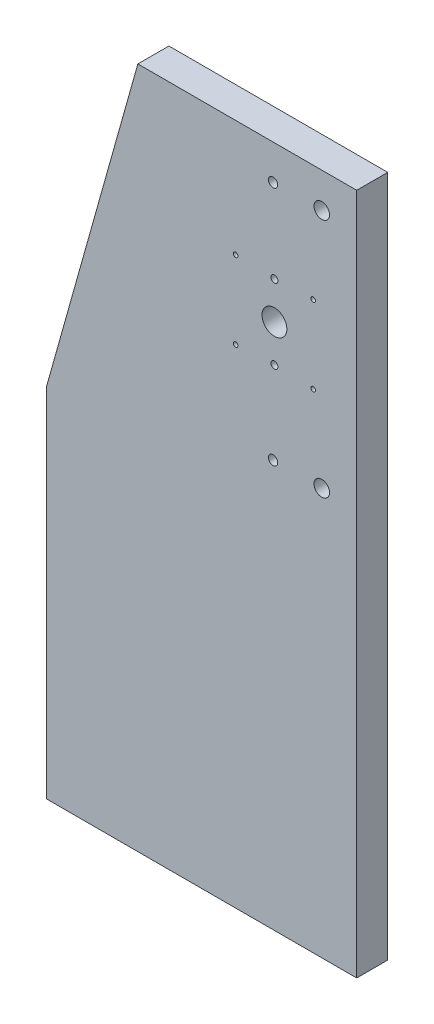
ISO-10303-21;
HEADER;
FILE_DESCRIPTION(('STEP AP214'),'2;1');
FILE_NAME('part.step','',(''),(''),'','','');
FILE_SCHEMA(('AUTOMOTIVE_DESIGN { 1 0 10303 214 1 1 1 1 }'));
ENDSEC;
DATA;
#1=APPLICATION_CONTEXT('core data for automotive mechanical design processes');
#2=APPLICATION_PROTOCOL_DEFINITION('international standard','automotive_design',2000,#1);
#3=PRODUCT_CONTEXT('',#1,'mechanical');
#4=PRODUCT('Part','Part','',(#3));
#5=PRODUCT_RELATED_PRODUCT_CATEGORY('part','',(#4));
#6=PRODUCT_DEFINITION_FORMATION('','',#4);
#7=PRODUCT_DEFINITION_CONTEXT('part definition',#1,'design');
#8=PRODUCT_DEFINITION('design','',#6,#7);
#9=PRODUCT_DEFINITION_SHAPE('','',#8);
#10=(LENGTH_UNIT() NAMED_UNIT(*) SI_UNIT(.MILLI.,.METRE.));
#11=(NAMED_UNIT(*) PLANE_ANGLE_UNIT() SI_UNIT($,.RADIAN.));
#12=(NAMED_UNIT(*) SI_UNIT($,.STERADIAN.) SOLID_ANGLE_UNIT());
#13=UNCERTAINTY_MEASURE_WITH_UNIT(LENGTH_MEASURE(1.E-05),#10,'distance_accuracy_value','');
#14=(GEOMETRIC_REPRESENTATION_CONTEXT(3) GLOBAL_UNCERTAINTY_ASSIGNED_CONTEXT((#13)) GLOBAL_UNIT_ASSIGNED_CONTEXT((#10,
#11,#12)) REPRESENTATION_CONTEXT('',''));
#15=CARTESIAN_POINT('',(0.,0.,0.));
#16=DIRECTION('',(0.,0.,1.));
#17=DIRECTION('',(1.,0.,0.));
#18=AXIS2_PLACEMENT_3D('',#15,#16,#17);
#19=CARTESIAN_POINT('',(126.12492067,261.999912039992,20.));
#20=DIRECTION('',(0.,0.,-1.));
#21=DIRECTION('',(-1.,0.,0.));
#22=AXIS2_PLACEMENT_3D('',#19,#20,#21);
#23=CYLINDRICAL_SURFACE('',#22,2.99999999999999);
#24=CARTESIAN_POINT('',(126.12492067,261.999912039992,20.));
#25=DIRECTION('',(0.,0.,1.));
#26=DIRECTION('',(1.,0.,0.));
#27=AXIS2_PLACEMENT_3D('',#24,#25,#26);
#28=CIRCLE('',#27,2.99999999999999);
#29=CARTESIAN_POINT('',(129.12492067,261.999912039992,20.));
#30=VERTEX_POINT('',#29);
#31=EDGE_CURVE('E123',#30,#30,#28,.T.);
#32=ORIENTED_EDGE('',*,*,#31,.T.);
#33=EDGE_LOOP('',(#32));
#34=FACE_BOUND('',#33,.T.);
#35=CARTESIAN_POINT('',(126.12492067,261.999912039992,6.));
#36=DIRECTION('',(0.,0.,-1.));
#37=DIRECTION('',(-1.,0.,0.));
#38=AXIS2_PLACEMENT_3D('',#35,#36,#37);
#39=CIRCLE('',#38,2.99999999999999);
#40=CARTESIAN_POINT('',(123.12492067,261.999912039992,6.));
#41=VERTEX_POINT('',#40);
#42=EDGE_CURVE('E33',#41,#41,#39,.T.);
#43=ORIENTED_EDGE('',*,*,#42,.T.);
#44=EDGE_LOOP('',(#43));
#45=FACE_BOUND('',#44,.T.);
#46=ADVANCED_FACE('F29',(#34,#45),#23,.F.);
#47=CARTESIAN_POINT('',(126.12492067,416.999970679992,20.));
#48=DIRECTION('',(0.,0.,-1.));
#49=DIRECTION('',(-1.,0.,0.));
#50=AXIS2_PLACEMENT_3D('',#47,#48,#49);
#51=CYLINDRICAL_SURFACE('',#50,2.99999999999999);
#52=CARTESIAN_POINT('',(126.12492067,416.999970679992,20.));
#53=DIRECTION('',(0.,0.,1.));
#54=DIRECTION('',(1.,0.,0.));
#55=AXIS2_PLACEMENT_3D('',#52,#53,#54);
#56=CIRCLE('',#55,2.99999999999999);
#57=CARTESIAN_POINT('',(129.12492067,416.999970679992,20.));
#58=VERTEX_POINT('',#57);
#59=EDGE_CURVE('E96',#58,#58,#56,.T.);
#60=ORIENTED_EDGE('',*,*,#59,.T.);
#61=EDGE_LOOP('',(#60));
#62=FACE_BOUND('',#61,.T.);
#63=CARTESIAN_POINT('',(126.12492067,416.999970679992,6.));
#64=DIRECTION('',(0.,0.,-1.));
#65=DIRECTION('',(-1.,0.,0.));
#66=AXIS2_PLACEMENT_3D('',#63,#64,#65);
#67=CIRCLE('',#66,2.99999999999999);
#68=CARTESIAN_POINT('',(123.12492067,416.999970679992,6.));
#69=VERTEX_POINT('',#68);
#70=EDGE_CURVE('E129',#69,#69,#67,.T.);
#71=ORIENTED_EDGE('',*,*,#70,.T.);
#72=EDGE_LOOP('',(#71));
#73=FACE_BOUND('',#72,.T.);
#74=ADVANCED_FACE('F274',(#62,#73),#51,.F.);
#75=CARTESIAN_POINT('',(157.49992067,261.999912039992,20.));
#76=DIRECTION('',(0.,0.,-1.));
#77=DIRECTION('',(-1.,0.,0.));
#78=AXIS2_PLACEMENT_3D('',#75,#76,#77);
#79=CYLINDRICAL_SURFACE('',#78,4.99999999999999);
#80=CARTESIAN_POINT('',(157.49992067,261.999912039992,20.));
#81=DIRECTION('',(0.,0.,1.));
#82=DIRECTION('',(1.,0.,0.));
#83=AXIS2_PLACEMENT_3D('',#80,#81,#82);
#84=CIRCLE('',#83,4.99999999999999);
#85=CARTESIAN_POINT('',(162.49992067,261.999912039992,20.));
#86=VERTEX_POINT('',#85);
#87=EDGE_CURVE('E232',#86,#86,#84,.T.);
#88=ORIENTED_EDGE('',*,*,#87,.T.);
#89=EDGE_LOOP('',(#88));
#90=FACE_BOUND('',#89,.T.);
#91=CARTESIAN_POINT('',(157.49992067,261.999912039992,10.));
#92=DIRECTION('',(0.,0.,-1.));
#93=DIRECTION('',(-1.,0.,0.));
#94=AXIS2_PLACEMENT_3D('',#91,#92,#93);
#95=CIRCLE('',#94,4.99999999999999);
#96=CARTESIAN_POINT('',(152.49992067,261.999912039992,10.));
#97=VERTEX_POINT('',#96);
#98=EDGE_CURVE('E125',#97,#97,#95,.T.);
#99=ORIENTED_EDGE('',*,*,#98,.T.);
#100=EDGE_LOOP('',(#99));
#101=FACE_BOUND('',#100,.T.);
#102=ADVANCED_FACE('F281',(#90,#101),#79,.F.);
#103=CARTESIAN_POINT('',(157.49992067,416.999970679992,20.));
#104=DIRECTION('',(0.,0.,-1.));
#105=DIRECTION('',(-1.,0.,0.));
#106=AXIS2_PLACEMENT_3D('',#103,#104,#105);
#107=CYLINDRICAL_SURFACE('',#106,4.99999999999999);
#108=CARTESIAN_POINT('',(157.49992067,416.999970679992,20.));
#109=DIRECTION('',(0.,0.,1.));
#110=DIRECTION('',(1.,0.,0.));
#111=AXIS2_PLACEMENT_3D('',#108,#109,#110);
#112=CIRCLE('',#111,4.99999999999999);
#113=CARTESIAN_POINT('',(162.49992067,416.999970679992,20.));
#114=VERTEX_POINT('',#113);
#115=EDGE_CURVE('E235',#114,#114,#112,.T.);
#116=ORIENTED_EDGE('',*,*,#115,.T.);
#117=EDGE_LOOP('',(#116));
#118=FACE_BOUND('',#117,.T.);
#119=CARTESIAN_POINT('',(157.49992067,416.999970679992,10.));
#120=DIRECTION('',(0.,0.,-1.));
#121=DIRECTION('',(-1.,0.,0.));
#122=AXIS2_PLACEMENT_3D('',#119,#120,#121);
#123=CIRCLE('',#122,4.99999999999999);
#124=CARTESIAN_POINT('',(152.49992067,416.999970679992,10.));
#125=VERTEX_POINT('',#124);
#126=EDGE_CURVE('E120',#125,#125,#123,.T.);
#127=ORIENTED_EDGE('',*,*,#126,.T.);
#128=EDGE_LOOP('',(#127));
#129=FACE_BOUND('',#128,.T.);
#130=ADVANCED_FACE('F308',(#118,#129),#107,.F.);
#131=CARTESIAN_POINT('',(180.,0.,20.));
#132=DIRECTION('',(0.,0.,1.));
#133=DIRECTION('',(1.,0.,0.));
#134=AXIS2_PLACEMENT_3D('',#131,#132,#133);
#135=PLANE('',#134);
#136=CARTESIAN_POINT('',(101.999907999992,314.499941359992,20.));
#137=DIRECTION('',(0.,0.,1.));
#138=DIRECTION('',(1.,0.,0.));
#139=AXIS2_PLACEMENT_3D('',#136,#137,#138);
#140=CIRCLE('',#139,1.5);
#141=CARTESIAN_POINT('',(103.499907999992,314.499941359992,20.));
#142=VERTEX_POINT('',#141);
#143=EDGE_CURVE('E211',#142,#142,#140,.T.);
#144=ORIENTED_EDGE('',*,*,#143,.F.);
#145=EDGE_LOOP('',(#144));
#146=FACE_BOUND('',#145,.T.);
#147=CARTESIAN_POINT('',(151.999907999992,314.499941359992,20.));
#148=DIRECTION('',(0.,0.,1.));
#149=DIRECTION('',(1.,0.,0.));
#150=AXIS2_PLACEMENT_3D('',#147,#148,#149);
#151=CIRCLE('',#150,1.5);
#152=CARTESIAN_POINT('',(153.499907999992,314.499941359992,20.));
#153=VERTEX_POINT('',#152);
#154=EDGE_CURVE('E223',#153,#153,#151,.T.);
#155=ORIENTED_EDGE('',*,*,#154,.F.);
#156=EDGE_LOOP('',(#155));
#157=FACE_BOUND('',#156,.T.);
#158=ORIENTED_EDGE('',*,*,#87,.F.);
#159=EDGE_LOOP('',(#158));
#160=FACE_BOUND('',#159,.T.);
#161=CARTESIAN_POINT('',(126.999907999992,363.499941359992,20.));
#162=DIRECTION('',(0.,0.,1.));
#163=DIRECTION('',(1.,0.,0.));
#164=AXIS2_PLACEMENT_3D('',#161,#162,#163);
#165=CIRCLE('',#164,2.25000000000001);
#166=CARTESIAN_POINT('',(129.249907999992,363.499941359992,20.));
#167=VERTEX_POINT('',#166);
#168=EDGE_CURVE('E241',#167,#167,#165,.T.);
#169=ORIENTED_EDGE('',*,*,#168,.F.);
#170=EDGE_LOOP('',(#169));
#171=FACE_BOUND('',#170,.T.);
#172=CARTESIAN_POINT('',(126.999907999993,339.499941359992,20.));
#173=DIRECTION('',(0.,0.,1.));
#174=DIRECTION('',(1.,0.,0.));
#175=AXIS2_PLACEMENT_3D('',#172,#173,#174);
#176=CIRCLE('',#175,7.99999999999996);
#177=CARTESIAN_POINT('',(134.999907999992,339.499941359992,20.));
#178=VERTEX_POINT('',#177);
#179=EDGE_CURVE('E253',#178,#178,#176,.T.);
#180=ORIENTED_EDGE('',*,*,#179,.F.);
#181=EDGE_LOOP('',(#180));
#182=FACE_BOUND('',#181,.T.);
#183=DIRECTION('',(0.,1.,0.));
#184=VECTOR('',#183,1.);
#185=CARTESIAN_POINT('',(180.,20.,20.));
#186=LINE('',#185,#184);
#187=CARTESIAN_POINT('',(180.,0.,20.));
#188=VERTEX_POINT('',#187);
#189=CARTESIAN_POINT('',(180.,439.500014530256,20.));
#190=VERTEX_POINT('',#189);
#191=EDGE_CURVE('E46',#188,#190,#186,.T.);
#192=ORIENTED_EDGE('',*,*,#191,.T.);
#193=DIRECTION('',(-0.999999999999865,-5.18937700120816E-07,0.));
#194=VECTOR('',#193,1.);
#195=CARTESIAN_POINT('',(180.,439.500014530256,20.));
#196=LINE('',#195,#194);
#197=CARTESIAN_POINT('',(38.9999079999848,439.499941359992,20.));
#198=VERTEX_POINT('',#197);
#199=EDGE_CURVE('E98',#190,#198,#196,.T.);
#200=ORIENTED_EDGE('',*,*,#199,.T.);
#201=DIRECTION('',(-0.270479653463599,-0.962725691493798,0.));
#202=VECTOR('',#201,1.);
#203=CARTESIAN_POINT('',(38.9999079999848,439.499941359992,20.));
#204=LINE('',#203,#202);
#205=CARTESIAN_POINT('',(-20.,229.499941359992,20.));
#206=VERTEX_POINT('',#205);
#207=EDGE_CURVE('E100',#198,#206,#204,.T.);
#208=ORIENTED_EDGE('',*,*,#207,.T.);
#209=DIRECTION('',(0.,-1.,0.));
#210=VECTOR('',#209,1.);
#211=CARTESIAN_POINT('',(-20.,229.499941359992,20.));
#212=LINE('',#211,#210);
#213=CARTESIAN_POINT('',(-20.,0.,20.));
#214=VERTEX_POINT('',#213);
#215=EDGE_CURVE('E53',#206,#214,#212,.T.);
#216=ORIENTED_EDGE('',*,*,#215,.T.);
#217=DIRECTION('',(1.,0.,0.));
#218=VECTOR('',#217,1.);
#219=CARTESIAN_POINT('',(180.,0.,20.));
#220=LINE('',#219,#218);
#221=EDGE_CURVE('E105',#214,#188,#220,.T.);
#222=ORIENTED_EDGE('',*,*,#221,.T.);
#223=EDGE_LOOP('',(#192,#200,#208,#216,#222));
#224=FACE_BOUND('',#223,.T.);
#225=ORIENTED_EDGE('',*,*,#59,.F.);
#226=EDGE_LOOP('',(#225));
#227=FACE_BOUND('',#226,.T.);
#228=CARTESIAN_POINT('',(126.999907999992,315.499941359992,20.));
#229=DIRECTION('',(0.,0.,1.));
#230=DIRECTION('',(1.,0.,0.));
#231=AXIS2_PLACEMENT_3D('',#228,#229,#230);
#232=CIRCLE('',#231,2.25000000000001);
#233=CARTESIAN_POINT('',(129.249907999992,315.499941359992,20.));
#234=VERTEX_POINT('',#233);
#235=EDGE_CURVE('E247',#234,#234,#232,.T.);
#236=ORIENTED_EDGE('',*,*,#235,.F.);
#237=EDGE_LOOP('',(#236));
#238=FACE_BOUND('',#237,.T.);
#239=ORIENTED_EDGE('',*,*,#115,.F.);
#240=EDGE_LOOP('',(#239));
#241=FACE_BOUND('',#240,.T.);
#242=CARTESIAN_POINT('',(151.999907999992,364.499941359992,20.));
#243=DIRECTION('',(0.,0.,1.));
#244=DIRECTION('',(1.,0.,0.));
#245=AXIS2_PLACEMENT_3D('',#242,#243,#244);
#246=CIRCLE('',#245,1.5);
#247=CARTESIAN_POINT('',(153.499907999992,364.499941359992,20.));
#248=VERTEX_POINT('',#247);
#249=EDGE_CURVE('E229',#248,#248,#246,.T.);
#250=ORIENTED_EDGE('',*,*,#249,.F.);
#251=EDGE_LOOP('',(#250));
#252=FACE_BOUND('',#251,.T.);
#253=CARTESIAN_POINT('',(101.999907999992,364.499941359992,20.));
#254=DIRECTION('',(0.,0.,1.));
#255=DIRECTION('',(1.,0.,0.));
#256=AXIS2_PLACEMENT_3D('',#253,#254,#255);
#257=CIRCLE('',#256,1.5);
#258=CARTESIAN_POINT('',(103.499907999992,364.499941359992,20.));
#259=VERTEX_POINT('',#258);
#260=EDGE_CURVE('E217',#259,#259,#257,.T.);
#261=ORIENTED_EDGE('',*,*,#260,.F.);
#262=EDGE_LOOP('',(#261));
#263=FACE_BOUND('',#262,.T.);
#264=ORIENTED_EDGE('',*,*,#31,.F.);
#265=EDGE_LOOP('',(#264));
#266=FACE_BOUND('',#265,.T.);
#267=ADVANCED_FACE('F102',(#146,#157,#160,#171,#182,#224,#227,#238,#241,#252,#263,#266),#135,.T.);
#268=CARTESIAN_POINT('',(180.,0.,0.));
#269=DIRECTION('',(0.,0.,1.));
#270=DIRECTION('',(1.,0.,0.));
#271=AXIS2_PLACEMENT_3D('',#268,#269,#270);
#272=PLANE('',#271);
#273=CARTESIAN_POINT('',(126.12492067,261.999912039992,0.));
#274=DIRECTION('',(0.,0.,-1.));
#275=DIRECTION('',(-1.,0.,0.));
#276=AXIS2_PLACEMENT_3D('',#273,#274,#275);
#277=CIRCLE('',#276,5.00000000000001);
#278=CARTESIAN_POINT('',(121.12492067,261.999912039992,0.));
#279=VERTEX_POINT('',#278);
#280=EDGE_CURVE('E669',#279,#279,#277,.T.);
#281=ORIENTED_EDGE('',*,*,#280,.F.);
#282=EDGE_LOOP('',(#281));
#283=FACE_BOUND('',#282,.T.);
#284=CARTESIAN_POINT('',(126.12492067,416.999970679992,0.));
#285=DIRECTION('',(0.,0.,-1.));
#286=DIRECTION('',(-1.,0.,0.));
#287=AXIS2_PLACEMENT_3D('',#284,#285,#286);
#288=CIRCLE('',#287,5.00000000000001);
#289=CARTESIAN_POINT('',(121.12492067,416.999970679992,0.));
#290=VERTEX_POINT('',#289);
#291=EDGE_CURVE('E139',#290,#290,#288,.T.);
#292=ORIENTED_EDGE('',*,*,#291,.F.);
#293=EDGE_LOOP('',(#292));
#294=FACE_BOUND('',#293,.T.);
#295=CARTESIAN_POINT('',(157.49992067,261.999912039992,0.));
#296=DIRECTION('',(0.,0.,-1.));
#297=DIRECTION('',(-1.,0.,0.));
#298=AXIS2_PLACEMENT_3D('',#295,#296,#297);
#299=CIRCLE('',#298,8.00000000000001);
#300=CARTESIAN_POINT('',(149.49992067,261.999912039992,0.));
#301=VERTEX_POINT('',#300);
#302=EDGE_CURVE('E197',#301,#301,#299,.T.);
#303=ORIENTED_EDGE('',*,*,#302,.F.);
#304=EDGE_LOOP('',(#303));
#305=FACE_BOUND('',#304,.T.);
#306=CARTESIAN_POINT('',(157.49992067,416.999970679992,0.));
#307=DIRECTION('',(0.,0.,-1.));
#308=DIRECTION('',(-1.,0.,0.));
#309=AXIS2_PLACEMENT_3D('',#306,#307,#308);
#310=CIRCLE('',#309,8.00000000000001);
#311=CARTESIAN_POINT('',(149.49992067,416.999970679992,0.));
#312=VERTEX_POINT('',#311);
#313=EDGE_CURVE('E127',#312,#312,#310,.T.);
#314=ORIENTED_EDGE('',*,*,#313,.F.);
#315=EDGE_LOOP('',(#314));
#316=FACE_BOUND('',#315,.T.);
#317=CARTESIAN_POINT('',(101.999907999992,314.499941359992,0.));
#318=DIRECTION('',(0.,0.,1.));
#319=DIRECTION('',(1.,0.,0.));
#320=AXIS2_PLACEMENT_3D('',#317,#318,#319);
#321=CIRCLE('',#320,1.5);
#322=CARTESIAN_POINT('',(103.499907999992,314.499941359992,0.));
#323=VERTEX_POINT('',#322);
#324=EDGE_CURVE('E208',#323,#323,#321,.T.);
#325=ORIENTED_EDGE('',*,*,#324,.T.);
#326=EDGE_LOOP('',(#325));
#327=FACE_BOUND('',#326,.T.);
#328=CARTESIAN_POINT('',(151.999907999992,314.499941359992,0.));
#329=DIRECTION('',(0.,0.,1.));
#330=DIRECTION('',(1.,0.,0.));
#331=AXIS2_PLACEMENT_3D('',#328,#329,#330);
#332=CIRCLE('',#331,1.5);
#333=CARTESIAN_POINT('',(153.499907999992,314.499941359992,0.));
#334=VERTEX_POINT('',#333);
#335=EDGE_CURVE('E220',#334,#334,#332,.T.);
#336=ORIENTED_EDGE('',*,*,#335,.T.);
#337=EDGE_LOOP('',(#336));
#338=FACE_BOUND('',#337,.T.);
#339=CARTESIAN_POINT('',(126.999907999992,363.499941359992,0.));
#340=DIRECTION('',(0.,0.,1.));
#341=DIRECTION('',(1.,0.,0.));
#342=AXIS2_PLACEMENT_3D('',#339,#340,#341);
#343=CIRCLE('',#342,2.25000000000001);
#344=CARTESIAN_POINT('',(129.249907999992,363.499941359992,0.));
#345=VERTEX_POINT('',#344);
#346=EDGE_CURVE('E238',#345,#345,#343,.T.);
#347=ORIENTED_EDGE('',*,*,#346,.T.);
#348=EDGE_LOOP('',(#347));
#349=FACE_BOUND('',#348,.T.);
#350=CARTESIAN_POINT('',(126.999907999993,339.499941359992,0.));
#351=DIRECTION('',(0.,0.,1.));
#352=DIRECTION('',(1.,0.,0.));
#353=AXIS2_PLACEMENT_3D('',#350,#351,#352);
#354=CIRCLE('',#353,7.99999999999996);
#355=CARTESIAN_POINT('',(134.999907999992,339.499941359992,0.));
#356=VERTEX_POINT('',#355);
#357=EDGE_CURVE('E250',#356,#356,#354,.T.);
#358=ORIENTED_EDGE('',*,*,#357,.T.);
#359=EDGE_LOOP('',(#358));
#360=FACE_BOUND('',#359,.T.);
#361=DIRECTION('',(-0.999999999999865,-5.18937700120816E-07,0.));
#362=VECTOR('',#361,1.);
#363=CARTESIAN_POINT('',(180.,439.500014530256,0.));
#364=LINE('',#363,#362);
#365=CARTESIAN_POINT('',(180.,439.500014530256,0.));
#366=VERTEX_POINT('',#365);
#367=CARTESIAN_POINT('',(38.9999079999848,439.499941359992,0.));
#368=VERTEX_POINT('',#367);
#369=EDGE_CURVE('E88',#366,#368,#364,.T.);
#370=ORIENTED_EDGE('',*,*,#369,.F.);
#371=DIRECTION('',(0.,1.,0.));
#372=VECTOR('',#371,1.);
#373=CARTESIAN_POINT('',(180.,20.,0.));
#374=LINE('',#373,#372);
#375=CARTESIAN_POINT('',(180.,0.,0.));
#376=VERTEX_POINT('',#375);
#377=EDGE_CURVE('E78',#376,#366,#374,.T.);
#378=ORIENTED_EDGE('',*,*,#377,.F.);
#379=DIRECTION('',(1.,0.,0.));
#380=VECTOR('',#379,1.);
#381=CARTESIAN_POINT('',(180.,0.,0.));
#382=LINE('',#381,#380);
#383=CARTESIAN_POINT('',(-20.,0.,0.));
#384=VERTEX_POINT('',#383);
#385=EDGE_CURVE('E85',#384,#376,#382,.T.);
#386=ORIENTED_EDGE('',*,*,#385,.F.);
#387=DIRECTION('',(0.,-1.,0.));
#388=VECTOR('',#387,1.);
#389=CARTESIAN_POINT('',(-20.,229.499941359992,0.));
#390=LINE('',#389,#388);
#391=CARTESIAN_POINT('',(-20.,229.499941359992,0.));
#392=VERTEX_POINT('',#391);
#393=EDGE_CURVE('E259',#392,#384,#390,.T.);
#394=ORIENTED_EDGE('',*,*,#393,.F.);
#395=DIRECTION('',(-0.270479653463599,-0.962725691493798,0.));
#396=VECTOR('',#395,1.);
#397=CARTESIAN_POINT('',(38.9999079999848,439.499941359992,0.));
#398=LINE('',#397,#396);
#399=EDGE_CURVE('E92',#368,#392,#398,.T.);
#400=ORIENTED_EDGE('',*,*,#399,.F.);
#401=EDGE_LOOP('',(#370,#378,#386,#394,#400));
#402=FACE_BOUND('',#401,.T.);
#403=CARTESIAN_POINT('',(126.999907999992,315.499941359992,0.));
#404=DIRECTION('',(0.,0.,1.));
#405=DIRECTION('',(1.,0.,0.));
#406=AXIS2_PLACEMENT_3D('',#403,#404,#405);
#407=CIRCLE('',#406,2.25000000000001);
#408=CARTESIAN_POINT('',(129.249907999992,315.499941359992,0.));
#409=VERTEX_POINT('',#408);
#410=EDGE_CURVE('E244',#409,#409,#407,.T.);
#411=ORIENTED_EDGE('',*,*,#410,.T.);
#412=EDGE_LOOP('',(#411));
#413=FACE_BOUND('',#412,.T.);
#414=CARTESIAN_POINT('',(151.999907999992,364.499941359992,0.));
#415=DIRECTION('',(0.,0.,1.));
#416=DIRECTION('',(1.,0.,0.));
#417=AXIS2_PLACEMENT_3D('',#414,#415,#416);
#418=CIRCLE('',#417,1.5);
#419=CARTESIAN_POINT('',(153.499907999992,364.499941359992,0.));
#420=VERTEX_POINT('',#419);
#421=EDGE_CURVE('E226',#420,#420,#418,.T.);
#422=ORIENTED_EDGE('',*,*,#421,.T.);
#423=EDGE_LOOP('',(#422));
#424=FACE_BOUND('',#423,.T.);
#425=CARTESIAN_POINT('',(101.999907999992,364.499941359992,0.));
#426=DIRECTION('',(0.,0.,1.));
#427=DIRECTION('',(1.,0.,0.));
#428=AXIS2_PLACEMENT_3D('',#425,#426,#427);
#429=CIRCLE('',#428,1.5);
#430=CARTESIAN_POINT('',(103.499907999992,364.499941359992,0.));
#431=VERTEX_POINT('',#430);
#432=EDGE_CURVE('E214',#431,#431,#429,.T.);
#433=ORIENTED_EDGE('',*,*,#432,.T.);
#434=EDGE_LOOP('',(#433));
#435=FACE_BOUND('',#434,.T.);
#436=ADVANCED_FACE('F89',(#283,#294,#305,#316,#327,#338,#349,#360,#402,#413,#424,#435),#272,.F.);
#437=CARTESIAN_POINT('',(180.,439.500014530256,20.));
#438=DIRECTION('',(5.18937700120816E-07,-0.999999999999865,0.));
#439=DIRECTION('',(0.999999999999865,5.18937700120816E-07,0.));
#440=AXIS2_PLACEMENT_3D('',#437,#438,#439);
#441=PLANE('',#440);
#442=ORIENTED_EDGE('',*,*,#369,.T.);
#443=DIRECTION('',(0.,0.,-1.));
#444=VECTOR('',#443,1.);
#445=CARTESIAN_POINT('',(38.9999079999848,439.499941359992,20.));
#446=LINE('',#445,#444);
#447=EDGE_CURVE('E38',#198,#368,#446,.T.);
#448=ORIENTED_EDGE('',*,*,#447,.F.);
#449=ORIENTED_EDGE('',*,*,#199,.F.);
#450=DIRECTION('',(0.,0.,-1.));
#451=VECTOR('',#450,1.);
#452=CARTESIAN_POINT('',(180.,439.500014530256,20.));
#453=LINE('',#452,#451);
#454=EDGE_CURVE('E11',#190,#366,#453,.T.);
#455=ORIENTED_EDGE('',*,*,#454,.T.);
#456=EDGE_LOOP('',(#442,#448,#449,#455));
#457=FACE_BOUND('',#456,.T.);
#458=ADVANCED_FACE('F31',(#457),#441,.F.);
#459=CARTESIAN_POINT('',(38.9999079999848,439.499941359992,20.));
#460=DIRECTION('',(0.962725691493798,-0.270479653463599,0.));
#461=DIRECTION('',(0.270479653463599,0.962725691493798,0.));
#462=AXIS2_PLACEMENT_3D('',#459,#460,#461);
#463=PLANE('',#462);
#464=ORIENTED_EDGE('',*,*,#399,.T.);
#465=DIRECTION('',(0.,0.,-1.));
#466=VECTOR('',#465,1.);
#467=CARTESIAN_POINT('',(-20.,229.499941359992,20.));
#468=LINE('',#467,#466);
#469=EDGE_CURVE('E116',#206,#392,#468,.T.);
#470=ORIENTED_EDGE('',*,*,#469,.F.);
#471=ORIENTED_EDGE('',*,*,#207,.F.);
#472=ORIENTED_EDGE('',*,*,#447,.T.);
#473=EDGE_LOOP('',(#464,#470,#471,#472));
#474=FACE_BOUND('',#473,.T.);
#475=ADVANCED_FACE('F266',(#474),#463,.F.);
#476=CARTESIAN_POINT('',(-20.,229.499941359992,20.));
#477=DIRECTION('',(1.,0.,0.));
#478=DIRECTION('',(0.,1.,0.));
#479=AXIS2_PLACEMENT_3D('',#476,#477,#478);
#480=PLANE('',#479);
#481=ORIENTED_EDGE('',*,*,#393,.T.);
#482=DIRECTION('',(0.,0.,-1.));
#483=VECTOR('',#482,1.);
#484=CARTESIAN_POINT('',(-20.,0.,20.));
#485=LINE('',#484,#483);
#486=EDGE_CURVE('E113',#214,#384,#485,.T.);
#487=ORIENTED_EDGE('',*,*,#486,.F.);
#488=ORIENTED_EDGE('',*,*,#215,.F.);
#489=ORIENTED_EDGE('',*,*,#469,.T.);
#490=EDGE_LOOP('',(#481,#487,#488,#489));
#491=FACE_BOUND('',#490,.T.);
#492=ADVANCED_FACE('F263',(#491),#480,.F.);
#493=CARTESIAN_POINT('',(180.,0.,20.));
#494=DIRECTION('',(0.,1.,0.));
#495=DIRECTION('',(0.,0.,1.));
#496=AXIS2_PLACEMENT_3D('',#493,#494,#495);
#497=PLANE('',#496);
#498=CARTESIAN_POINT('',(0.,0.,9.99999999999998));
#499=DIRECTION('',(0.,-1.,0.));
#500=DIRECTION('',(0.,0.,-1.));
#501=AXIS2_PLACEMENT_3D('',#498,#499,#500);
#502=CIRCLE('',#501,3.25);
#503=CARTESIAN_POINT('',(0.,0.,6.74999999999998));
#504=VERTEX_POINT('',#503);
#505=EDGE_CURVE('E131',#504,#504,#502,.T.);
#506=ORIENTED_EDGE('',*,*,#505,.F.);
#507=EDGE_LOOP('',(#506));
#508=FACE_BOUND('',#507,.T.);
#509=CARTESIAN_POINT('',(160.,0.,9.99999999999998));
#510=DIRECTION('',(0.,-1.,0.));
#511=DIRECTION('',(0.,0.,-1.));
#512=AXIS2_PLACEMENT_3D('',#509,#510,#511);
#513=CIRCLE('',#512,3.25000000000001);
#514=CARTESIAN_POINT('',(160.,0.,6.74999999999998));
#515=VERTEX_POINT('',#514);
#516=EDGE_CURVE('E149',#515,#515,#513,.T.);
#517=ORIENTED_EDGE('',*,*,#516,.F.);
#518=EDGE_LOOP('',(#517));
#519=FACE_BOUND('',#518,.T.);
#520=CARTESIAN_POINT('',(140.,0.,9.99999999999998));
#521=DIRECTION('',(0.,-1.,0.));
#522=DIRECTION('',(0.,0.,-1.));
#523=AXIS2_PLACEMENT_3D('',#520,#521,#522);
#524=CIRCLE('',#523,3.25000000000001);
#525=CARTESIAN_POINT('',(140.,0.,6.74999999999998));
#526=VERTEX_POINT('',#525);
#527=EDGE_CURVE('E155',#526,#526,#524,.T.);
#528=ORIENTED_EDGE('',*,*,#527,.F.);
#529=EDGE_LOOP('',(#528));
#530=FACE_BOUND('',#529,.T.);
#531=CARTESIAN_POINT('',(120.,0.,9.99999999999998));
#532=DIRECTION('',(0.,-1.,0.));
#533=DIRECTION('',(0.,0.,-1.));
#534=AXIS2_PLACEMENT_3D('',#531,#532,#533);
#535=CIRCLE('',#534,3.25000000000001);
#536=CARTESIAN_POINT('',(120.,0.,6.74999999999998));
#537=VERTEX_POINT('',#536);
#538=EDGE_CURVE('E161',#537,#537,#535,.T.);
#539=ORIENTED_EDGE('',*,*,#538,.F.);
#540=EDGE_LOOP('',(#539));
#541=FACE_BOUND('',#540,.T.);
#542=CARTESIAN_POINT('',(100.,0.,9.99999999999998));
#543=DIRECTION('',(0.,-1.,0.));
#544=DIRECTION('',(0.,0.,-1.));
#545=AXIS2_PLACEMENT_3D('',#542,#543,#544);
#546=CIRCLE('',#545,3.25000000000001);
#547=CARTESIAN_POINT('',(100.,0.,6.74999999999998));
#548=VERTEX_POINT('',#547);
#549=EDGE_CURVE('E167',#548,#548,#546,.T.);
#550=ORIENTED_EDGE('',*,*,#549,.F.);
#551=EDGE_LOOP('',(#550));
#552=FACE_BOUND('',#551,.T.);
#553=CARTESIAN_POINT('',(80.,0.,9.99999999999998));
#554=DIRECTION('',(0.,-1.,0.));
#555=DIRECTION('',(0.,0.,-1.));
#556=AXIS2_PLACEMENT_3D('',#553,#554,#555);
#557=CIRCLE('',#556,3.25000000000001);
#558=CARTESIAN_POINT('',(80.,0.,6.74999999999998));
#559=VERTEX_POINT('',#558);
#560=EDGE_CURVE('E173',#559,#559,#557,.T.);
#561=ORIENTED_EDGE('',*,*,#560,.F.);
#562=EDGE_LOOP('',(#561));
#563=FACE_BOUND('',#562,.T.);
#564=CARTESIAN_POINT('',(60.,0.,9.99999999999998));
#565=DIRECTION('',(0.,-1.,0.));
#566=DIRECTION('',(0.,0.,-1.));
#567=AXIS2_PLACEMENT_3D('',#564,#565,#566);
#568=CIRCLE('',#567,3.25);
#569=CARTESIAN_POINT('',(60.,0.,6.74999999999998));
#570=VERTEX_POINT('',#569);
#571=EDGE_CURVE('E179',#570,#570,#568,.T.);
#572=ORIENTED_EDGE('',*,*,#571,.F.);
#573=EDGE_LOOP('',(#572));
#574=FACE_BOUND('',#573,.T.);
#575=CARTESIAN_POINT('',(40.,0.,9.99999999999998));
#576=DIRECTION('',(0.,-1.,0.));
#577=DIRECTION('',(0.,0.,-1.));
#578=AXIS2_PLACEMENT_3D('',#575,#576,#577);
#579=CIRCLE('',#578,3.25);
#580=CARTESIAN_POINT('',(40.,0.,6.74999999999998));
#581=VERTEX_POINT('',#580);
#582=EDGE_CURVE('E185',#581,#581,#579,.T.);
#583=ORIENTED_EDGE('',*,*,#582,.F.);
#584=EDGE_LOOP('',(#583));
#585=FACE_BOUND('',#584,.T.);
#586=CARTESIAN_POINT('',(20.,0.,9.99999999999998));
#587=DIRECTION('',(0.,-1.,0.));
#588=DIRECTION('',(0.,0.,-1.));
#589=AXIS2_PLACEMENT_3D('',#586,#587,#588);
#590=CIRCLE('',#589,3.25);
#591=CARTESIAN_POINT('',(20.,0.,6.74999999999998));
#592=VERTEX_POINT('',#591);
#593=EDGE_CURVE('E191',#592,#592,#590,.T.);
#594=ORIENTED_EDGE('',*,*,#593,.F.);
#595=EDGE_LOOP('',(#594));
#596=FACE_BOUND('',#595,.T.);
#597=ORIENTED_EDGE('',*,*,#385,.T.);
#598=DIRECTION('',(0.,0.,-1.));
#599=VECTOR('',#598,1.);
#600=CARTESIAN_POINT('',(180.,0.,20.));
#601=LINE('',#600,#599);
#602=EDGE_CURVE('E82',#188,#376,#601,.T.);
#603=ORIENTED_EDGE('',*,*,#602,.F.);
#604=ORIENTED_EDGE('',*,*,#221,.F.);
#605=ORIENTED_EDGE('',*,*,#486,.T.);
#606=EDGE_LOOP('',(#597,#603,#604,#605));
#607=FACE_BOUND('',#606,.T.);
#608=ADVANCED_FACE('F261',(#508,#519,#530,#541,#552,#563,#574,#585,#596,#607),#497,.F.);
#609=CARTESIAN_POINT('',(180.,20.,20.));
#610=DIRECTION('',(-1.,0.,0.));
#611=DIRECTION('',(0.,0.,1.));
#612=AXIS2_PLACEMENT_3D('',#609,#610,#611);
#613=PLANE('',#612);
#614=ORIENTED_EDGE('',*,*,#377,.T.);
#615=ORIENTED_EDGE('',*,*,#454,.F.);
#616=ORIENTED_EDGE('',*,*,#191,.F.);
#617=ORIENTED_EDGE('',*,*,#602,.T.);
#618=EDGE_LOOP('',(#614,#615,#616,#617));
#619=FACE_BOUND('',#618,.T.);
#620=ADVANCED_FACE('F80',(#619),#613,.F.);
#621=CARTESIAN_POINT('',(126.999907999993,339.499941359992,20.));
#622=DIRECTION('',(0.,0.,-1.));
#623=DIRECTION('',(-1.,0.,0.));
#624=AXIS2_PLACEMENT_3D('',#621,#622,#623);
#625=CYLINDRICAL_SURFACE('',#624,7.99999999999996);
#626=ORIENTED_EDGE('',*,*,#179,.T.);
#627=EDGE_LOOP('',(#626));
#628=FACE_BOUND('',#627,.T.);
#629=ORIENTED_EDGE('',*,*,#357,.F.);
#630=EDGE_LOOP('',(#629));
#631=FACE_BOUND('',#630,.T.);
#632=ADVANCED_FACE('F319',(#628,#631),#625,.F.);
#633=CARTESIAN_POINT('',(126.999907999992,315.499941359992,20.));
#634=DIRECTION('',(0.,0.,-1.));
#635=DIRECTION('',(-1.,0.,0.));
#636=AXIS2_PLACEMENT_3D('',#633,#634,#635);
#637=CYLINDRICAL_SURFACE('',#636,2.25000000000001);
#638=ORIENTED_EDGE('',*,*,#235,.T.);
#639=EDGE_LOOP('',(#638));
#640=FACE_BOUND('',#639,.T.);
#641=ORIENTED_EDGE('',*,*,#410,.F.);
#642=EDGE_LOOP('',(#641));
#643=FACE_BOUND('',#642,.T.);
#644=ADVANCED_FACE('F315',(#640,#643),#637,.F.);
#645=CARTESIAN_POINT('',(126.999907999992,363.499941359992,20.));
#646=DIRECTION('',(0.,0.,-1.));
#647=DIRECTION('',(-1.,0.,0.));
#648=AXIS2_PLACEMENT_3D('',#645,#646,#647);
#649=CYLINDRICAL_SURFACE('',#648,2.25000000000001);
#650=ORIENTED_EDGE('',*,*,#168,.T.);
#651=EDGE_LOOP('',(#650));
#652=FACE_BOUND('',#651,.T.);
#653=ORIENTED_EDGE('',*,*,#346,.F.);
#654=EDGE_LOOP('',(#653));
#655=FACE_BOUND('',#654,.T.);
#656=ADVANCED_FACE('F304',(#652,#655),#649,.F.);
#657=CARTESIAN_POINT('',(151.999907999992,364.499941359992,20.));
#658=DIRECTION('',(0.,0.,-1.));
#659=DIRECTION('',(-1.,0.,0.));
#660=AXIS2_PLACEMENT_3D('',#657,#658,#659);
#661=CYLINDRICAL_SURFACE('',#660,1.5);
#662=ORIENTED_EDGE('',*,*,#249,.T.);
#663=EDGE_LOOP('',(#662));
#664=FACE_BOUND('',#663,.T.);
#665=ORIENTED_EDGE('',*,*,#421,.F.);
#666=EDGE_LOOP('',(#665));
#667=FACE_BOUND('',#666,.T.);
#668=ADVANCED_FACE('F300',(#664,#667),#661,.F.);
#669=CARTESIAN_POINT('',(151.999907999992,314.499941359992,20.));
#670=DIRECTION('',(0.,0.,-1.));
#671=DIRECTION('',(-1.,0.,0.));
#672=AXIS2_PLACEMENT_3D('',#669,#670,#671);
#673=CYLINDRICAL_SURFACE('',#672,1.5);
#674=ORIENTED_EDGE('',*,*,#154,.T.);
#675=EDGE_LOOP('',(#674));
#676=FACE_BOUND('',#675,.T.);
#677=ORIENTED_EDGE('',*,*,#335,.F.);
#678=EDGE_LOOP('',(#677));
#679=FACE_BOUND('',#678,.T.);
#680=ADVANCED_FACE('F296',(#676,#679),#673,.F.);
#681=CARTESIAN_POINT('',(101.999907999992,364.499941359992,20.));
#682=DIRECTION('',(0.,0.,-1.));
#683=DIRECTION('',(-1.,0.,0.));
#684=AXIS2_PLACEMENT_3D('',#681,#682,#683);
#685=CYLINDRICAL_SURFACE('',#684,1.5);
#686=ORIENTED_EDGE('',*,*,#260,.T.);
#687=EDGE_LOOP('',(#686));
#688=FACE_BOUND('',#687,.T.);
#689=ORIENTED_EDGE('',*,*,#432,.F.);
#690=EDGE_LOOP('',(#689));
#691=FACE_BOUND('',#690,.T.);
#692=ADVANCED_FACE('F292',(#688,#691),#685,.F.);
#693=CARTESIAN_POINT('',(101.999907999992,314.499941359992,20.));
#694=DIRECTION('',(0.,0.,-1.));
#695=DIRECTION('',(-1.,0.,0.));
#696=AXIS2_PLACEMENT_3D('',#693,#694,#695);
#697=CYLINDRICAL_SURFACE('',#696,1.5);
#698=ORIENTED_EDGE('',*,*,#143,.T.);
#699=EDGE_LOOP('',(#698));
#700=FACE_BOUND('',#699,.T.);
#701=ORIENTED_EDGE('',*,*,#324,.F.);
#702=EDGE_LOOP('',(#701));
#703=FACE_BOUND('',#702,.T.);
#704=ADVANCED_FACE('F289',(#700,#703),#697,.F.);
#705=CARTESIAN_POINT('',(157.49992067,416.999970679992,10.));
#706=DIRECTION('',(0.,0.,-1.));
#707=DIRECTION('',(-1.,0.,0.));
#708=AXIS2_PLACEMENT_3D('',#705,#706,#707);
#709=CYLINDRICAL_SURFACE('',#708,8.00000000000001);
#710=CARTESIAN_POINT('',(157.49992067,416.999970679992,10.));
#711=DIRECTION('',(0.,0.,-1.));
#712=DIRECTION('',(-1.,0.,0.));
#713=AXIS2_PLACEMENT_3D('',#710,#711,#712);
#714=CIRCLE('',#713,8.00000000000001);
#715=CARTESIAN_POINT('',(149.49992067,416.999970679992,10.));
#716=VERTEX_POINT('',#715);
#717=EDGE_CURVE('E124',#716,#716,#714,.T.);
#718=ORIENTED_EDGE('',*,*,#717,.F.);
#719=EDGE_LOOP('',(#718));
#720=FACE_BOUND('',#719,.T.);
#721=ORIENTED_EDGE('',*,*,#313,.T.);
#722=EDGE_LOOP('',(#721));
#723=FACE_BOUND('',#722,.T.);
#724=ADVANCED_FACE('F287',(#720,#723),#709,.F.);
#725=CARTESIAN_POINT('',(157.49992067,416.999970679992,10.));
#726=DIRECTION('',(0.,0.,-1.));
#727=DIRECTION('',(-1.,0.,0.));
#728=AXIS2_PLACEMENT_3D('',#725,#726,#727);
#729=PLANE('',#728);
#730=ORIENTED_EDGE('',*,*,#126,.F.);
#731=EDGE_LOOP('',(#730));
#732=FACE_BOUND('',#731,.T.);
#733=ORIENTED_EDGE('',*,*,#717,.T.);
#734=EDGE_LOOP('',(#733));
#735=FACE_BOUND('',#734,.T.);
#736=ADVANCED_FACE('F374',(#732,#735),#729,.T.);
#737=CARTESIAN_POINT('',(157.49992067,261.999912039992,10.));
#738=DIRECTION('',(0.,0.,-1.));
#739=DIRECTION('',(-1.,0.,0.));
#740=AXIS2_PLACEMENT_3D('',#737,#738,#739);
#741=CYLINDRICAL_SURFACE('',#740,8.00000000000001);
#742=CARTESIAN_POINT('',(157.49992067,261.999912039992,10.));
#743=DIRECTION('',(0.,0.,-1.));
#744=DIRECTION('',(-1.,0.,0.));
#745=AXIS2_PLACEMENT_3D('',#742,#743,#744);
#746=CIRCLE('',#745,8.00000000000001);
#747=CARTESIAN_POINT('',(149.49992067,261.999912039992,10.));
#748=VERTEX_POINT('',#747);
#749=EDGE_CURVE('E128',#748,#748,#746,.T.);
#750=ORIENTED_EDGE('',*,*,#749,.F.);
#751=EDGE_LOOP('',(#750));
#752=FACE_BOUND('',#751,.T.);
#753=ORIENTED_EDGE('',*,*,#302,.T.);
#754=EDGE_LOOP('',(#753));
#755=FACE_BOUND('',#754,.T.);
#756=ADVANCED_FACE('F367',(#752,#755),#741,.F.);
#757=CARTESIAN_POINT('',(157.49992067,261.999912039992,10.));
#758=DIRECTION('',(0.,0.,-1.));
#759=DIRECTION('',(-1.,0.,0.));
#760=AXIS2_PLACEMENT_3D('',#757,#758,#759);
#761=PLANE('',#760);
#762=ORIENTED_EDGE('',*,*,#98,.F.);
#763=EDGE_LOOP('',(#762));
#764=FACE_BOUND('',#763,.T.);
#765=ORIENTED_EDGE('',*,*,#749,.T.);
#766=EDGE_LOOP('',(#765));
#767=FACE_BOUND('',#766,.T.);
#768=ADVANCED_FACE('F358',(#764,#767),#761,.T.);
#769=CARTESIAN_POINT('',(20.,60.,9.99999999999998));
#770=DIRECTION('',(0.,-1.,0.));
#771=DIRECTION('',(0.,0.,-1.));
#772=AXIS2_PLACEMENT_3D('',#769,#770,#771);
#773=CYLINDRICAL_SURFACE('',#772,3.25);
#774=CARTESIAN_POINT('',(20.,60.,9.99999999999998));
#775=DIRECTION('',(0.,-1.,0.));
#776=DIRECTION('',(0.,0.,-1.));
#777=AXIS2_PLACEMENT_3D('',#774,#775,#776);
#778=CIRCLE('',#777,3.25);
#779=CARTESIAN_POINT('',(20.,60.,6.74999999999998));
#780=VERTEX_POINT('',#779);
#781=EDGE_CURVE('E194',#780,#780,#778,.T.);
#782=ORIENTED_EDGE('',*,*,#781,.F.);
#783=EDGE_LOOP('',(#782));
#784=FACE_BOUND('',#783,.T.);
#785=ORIENTED_EDGE('',*,*,#593,.T.);
#786=EDGE_LOOP('',(#785));
#787=FACE_BOUND('',#786,.T.);
#788=ADVANCED_FACE('F356',(#784,#787),#773,.F.);
#789=CARTESIAN_POINT('',(20.,60.,9.99999999999998));
#790=DIRECTION('',(0.,-1.,0.));
#791=DIRECTION('',(0.,0.,-1.));
#792=AXIS2_PLACEMENT_3D('',#789,#790,#791);
#793=PLANE('',#792);
#794=ORIENTED_EDGE('',*,*,#781,.T.);
#795=EDGE_LOOP('',(#794));
#796=FACE_BOUND('',#795,.T.);
#797=ADVANCED_FACE('F357',(#796),#793,.T.);
#798=CARTESIAN_POINT('',(40.,60.,9.99999999999998));
#799=DIRECTION('',(0.,-1.,0.));
#800=DIRECTION('',(0.,0.,-1.));
#801=AXIS2_PLACEMENT_3D('',#798,#799,#800);
#802=CYLINDRICAL_SURFACE('',#801,3.25);
#803=CARTESIAN_POINT('',(40.,60.,9.99999999999998));
#804=DIRECTION('',(0.,-1.,0.));
#805=DIRECTION('',(0.,0.,-1.));
#806=AXIS2_PLACEMENT_3D('',#803,#804,#805);
#807=CIRCLE('',#806,3.25);
#808=CARTESIAN_POINT('',(40.,60.,6.74999999999998));
#809=VERTEX_POINT('',#808);
#810=EDGE_CURVE('E188',#809,#809,#807,.T.);
#811=ORIENTED_EDGE('',*,*,#810,.F.);
#812=EDGE_LOOP('',(#811));
#813=FACE_BOUND('',#812,.T.);
#814=ORIENTED_EDGE('',*,*,#582,.T.);
#815=EDGE_LOOP('',(#814));
#816=FACE_BOUND('',#815,.T.);
#817=ADVANCED_FACE('F364',(#813,#816),#802,.F.);
#818=CARTESIAN_POINT('',(40.,60.,9.99999999999998));
#819=DIRECTION('',(0.,-1.,0.));
#820=DIRECTION('',(0.,0.,-1.));
#821=AXIS2_PLACEMENT_3D('',#818,#819,#820);
#822=PLANE('',#821);
#823=ORIENTED_EDGE('',*,*,#810,.T.);
#824=EDGE_LOOP('',(#823));
#825=FACE_BOUND('',#824,.T.);
#826=ADVANCED_FACE('F559',(#825),#822,.T.);
#827=CARTESIAN_POINT('',(60.,60.,9.99999999999998));
#828=DIRECTION('',(0.,-1.,0.));
#829=DIRECTION('',(0.,0.,-1.));
#830=AXIS2_PLACEMENT_3D('',#827,#828,#829);
#831=CYLINDRICAL_SURFACE('',#830,3.25);
#832=CARTESIAN_POINT('',(60.,60.,9.99999999999998));
#833=DIRECTION('',(0.,-1.,0.));
#834=DIRECTION('',(0.,0.,-1.));
#835=AXIS2_PLACEMENT_3D('',#832,#833,#834);
#836=CIRCLE('',#835,3.25);
#837=CARTESIAN_POINT('',(60.,60.,6.74999999999998));
#838=VERTEX_POINT('',#837);
#839=EDGE_CURVE('E182',#838,#838,#836,.T.);
#840=ORIENTED_EDGE('',*,*,#839,.F.);
#841=EDGE_LOOP('',(#840));
#842=FACE_BOUND('',#841,.T.);
#843=ORIENTED_EDGE('',*,*,#571,.T.);
#844=EDGE_LOOP('',(#843));
#845=FACE_BOUND('',#844,.T.);
#846=ADVANCED_FACE('F555',(#842,#845),#831,.F.);
#847=CARTESIAN_POINT('',(60.,60.,9.99999999999998));
#848=DIRECTION('',(0.,-1.,0.));
#849=DIRECTION('',(0.,0.,-1.));
#850=AXIS2_PLACEMENT_3D('',#847,#848,#849);
#851=PLANE('',#850);
#852=ORIENTED_EDGE('',*,*,#839,.T.);
#853=EDGE_LOOP('',(#852));
#854=FACE_BOUND('',#853,.T.);
#855=ADVANCED_FACE('F551',(#854),#851,.T.);
#856=CARTESIAN_POINT('',(80.,60.,9.99999999999998));
#857=DIRECTION('',(0.,-1.,0.));
#858=DIRECTION('',(0.,0.,-1.));
#859=AXIS2_PLACEMENT_3D('',#856,#857,#858);
#860=CYLINDRICAL_SURFACE('',#859,3.25000000000001);
#861=CARTESIAN_POINT('',(80.,60.,9.99999999999998));
#862=DIRECTION('',(0.,-1.,0.));
#863=DIRECTION('',(0.,0.,-1.));
#864=AXIS2_PLACEMENT_3D('',#861,#862,#863);
#865=CIRCLE('',#864,3.25000000000001);
#866=CARTESIAN_POINT('',(80.,60.,6.74999999999998));
#867=VERTEX_POINT('',#866);
#868=EDGE_CURVE('E176',#867,#867,#865,.T.);
#869=ORIENTED_EDGE('',*,*,#868,.F.);
#870=EDGE_LOOP('',(#869));
#871=FACE_BOUND('',#870,.T.);
#872=ORIENTED_EDGE('',*,*,#560,.T.);
#873=EDGE_LOOP('',(#872));
#874=FACE_BOUND('',#873,.T.);
#875=ADVANCED_FACE('F547',(#871,#874),#860,.F.);
#876=CARTESIAN_POINT('',(80.,60.,9.99999999999998));
#877=DIRECTION('',(0.,-1.,0.));
#878=DIRECTION('',(0.,0.,-1.));
#879=AXIS2_PLACEMENT_3D('',#876,#877,#878);
#880=PLANE('',#879);
#881=ORIENTED_EDGE('',*,*,#868,.T.);
#882=EDGE_LOOP('',(#881));
#883=FACE_BOUND('',#882,.T.);
#884=ADVANCED_FACE('F543',(#883),#880,.T.);
#885=CARTESIAN_POINT('',(100.,60.,9.99999999999998));
#886=DIRECTION('',(0.,-1.,0.));
#887=DIRECTION('',(0.,0.,-1.));
#888=AXIS2_PLACEMENT_3D('',#885,#886,#887);
#889=CYLINDRICAL_SURFACE('',#888,3.25000000000001);
#890=CARTESIAN_POINT('',(100.,60.,9.99999999999998));
#891=DIRECTION('',(0.,-1.,0.));
#892=DIRECTION('',(0.,0.,-1.));
#893=AXIS2_PLACEMENT_3D('',#890,#891,#892);
#894=CIRCLE('',#893,3.25000000000001);
#895=CARTESIAN_POINT('',(100.,60.,6.74999999999998));
#896=VERTEX_POINT('',#895);
#897=EDGE_CURVE('E170',#896,#896,#894,.T.);
#898=ORIENTED_EDGE('',*,*,#897,.F.);
#899=EDGE_LOOP('',(#898));
#900=FACE_BOUND('',#899,.T.);
#901=ORIENTED_EDGE('',*,*,#549,.T.);
#902=EDGE_LOOP('',(#901));
#903=FACE_BOUND('',#902,.T.);
#904=ADVANCED_FACE('F539',(#900,#903),#889,.F.);
#905=CARTESIAN_POINT('',(100.,60.,9.99999999999998));
#906=DIRECTION('',(0.,-1.,0.));
#907=DIRECTION('',(0.,0.,-1.));
#908=AXIS2_PLACEMENT_3D('',#905,#906,#907);
#909=PLANE('',#908);
#910=ORIENTED_EDGE('',*,*,#897,.T.);
#911=EDGE_LOOP('',(#910));
#912=FACE_BOUND('',#911,.T.);
#913=ADVANCED_FACE('F535',(#912),#909,.T.);
#914=CARTESIAN_POINT('',(120.,60.,9.99999999999998));
#915=DIRECTION('',(0.,-1.,0.));
#916=DIRECTION('',(0.,0.,-1.));
#917=AXIS2_PLACEMENT_3D('',#914,#915,#916);
#918=CYLINDRICAL_SURFACE('',#917,3.25000000000001);
#919=CARTESIAN_POINT('',(120.,60.,9.99999999999998));
#920=DIRECTION('',(0.,-1.,0.));
#921=DIRECTION('',(0.,0.,-1.));
#922=AXIS2_PLACEMENT_3D('',#919,#920,#921);
#923=CIRCLE('',#922,3.25000000000001);
#924=CARTESIAN_POINT('',(120.,60.,6.74999999999998));
#925=VERTEX_POINT('',#924);
#926=EDGE_CURVE('E164',#925,#925,#923,.T.);
#927=ORIENTED_EDGE('',*,*,#926,.F.);
#928=EDGE_LOOP('',(#927));
#929=FACE_BOUND('',#928,.T.);
#930=ORIENTED_EDGE('',*,*,#538,.T.);
#931=EDGE_LOOP('',(#930));
#932=FACE_BOUND('',#931,.T.);
#933=ADVANCED_FACE('F531',(#929,#932),#918,.F.);
#934=CARTESIAN_POINT('',(120.,60.,9.99999999999998));
#935=DIRECTION('',(0.,-1.,0.));
#936=DIRECTION('',(0.,0.,-1.));
#937=AXIS2_PLACEMENT_3D('',#934,#935,#936);
#938=PLANE('',#937);
#939=ORIENTED_EDGE('',*,*,#926,.T.);
#940=EDGE_LOOP('',(#939));
#941=FACE_BOUND('',#940,.T.);
#942=ADVANCED_FACE('F527',(#941),#938,.T.);
#943=CARTESIAN_POINT('',(140.,60.,9.99999999999998));
#944=DIRECTION('',(0.,-1.,0.));
#945=DIRECTION('',(0.,0.,-1.));
#946=AXIS2_PLACEMENT_3D('',#943,#944,#945);
#947=CYLINDRICAL_SURFACE('',#946,3.25000000000001);
#948=CARTESIAN_POINT('',(140.,60.,9.99999999999998));
#949=DIRECTION('',(0.,-1.,0.));
#950=DIRECTION('',(0.,0.,-1.));
#951=AXIS2_PLACEMENT_3D('',#948,#949,#950);
#952=CIRCLE('',#951,3.25000000000001);
#953=CARTESIAN_POINT('',(140.,60.,6.74999999999998));
#954=VERTEX_POINT('',#953);
#955=EDGE_CURVE('E158',#954,#954,#952,.T.);
#956=ORIENTED_EDGE('',*,*,#955,.F.);
#957=EDGE_LOOP('',(#956));
#958=FACE_BOUND('',#957,.T.);
#959=ORIENTED_EDGE('',*,*,#527,.T.);
#960=EDGE_LOOP('',(#959));
#961=FACE_BOUND('',#960,.T.);
#962=ADVANCED_FACE('F523',(#958,#961),#947,.F.);
#963=CARTESIAN_POINT('',(140.,60.,9.99999999999998));
#964=DIRECTION('',(0.,-1.,0.));
#965=DIRECTION('',(0.,0.,-1.));
#966=AXIS2_PLACEMENT_3D('',#963,#964,#965);
#967=PLANE('',#966);
#968=ORIENTED_EDGE('',*,*,#955,.T.);
#969=EDGE_LOOP('',(#968));
#970=FACE_BOUND('',#969,.T.);
#971=ADVANCED_FACE('F519',(#970),#967,.T.);
#972=CARTESIAN_POINT('',(160.,60.,9.99999999999998));
#973=DIRECTION('',(0.,-1.,0.));
#974=DIRECTION('',(0.,0.,-1.));
#975=AXIS2_PLACEMENT_3D('',#972,#973,#974);
#976=CYLINDRICAL_SURFACE('',#975,3.25000000000001);
#977=CARTESIAN_POINT('',(160.,60.,9.99999999999998));
#978=DIRECTION('',(0.,-1.,0.));
#979=DIRECTION('',(0.,0.,-1.));
#980=AXIS2_PLACEMENT_3D('',#977,#978,#979);
#981=CIRCLE('',#980,3.25000000000001);
#982=CARTESIAN_POINT('',(160.,60.,6.74999999999998));
#983=VERTEX_POINT('',#982);
#984=EDGE_CURVE('E152',#983,#983,#981,.T.);
#985=ORIENTED_EDGE('',*,*,#984,.F.);
#986=EDGE_LOOP('',(#985));
#987=FACE_BOUND('',#986,.T.);
#988=ORIENTED_EDGE('',*,*,#516,.T.);
#989=EDGE_LOOP('',(#988));
#990=FACE_BOUND('',#989,.T.);
#991=ADVANCED_FACE('F515',(#987,#990),#976,.F.);
#992=CARTESIAN_POINT('',(160.,60.,9.99999999999998));
#993=DIRECTION('',(0.,-1.,0.));
#994=DIRECTION('',(0.,0.,-1.));
#995=AXIS2_PLACEMENT_3D('',#992,#993,#994);
#996=PLANE('',#995);
#997=ORIENTED_EDGE('',*,*,#984,.T.);
#998=EDGE_LOOP('',(#997));
#999=FACE_BOUND('',#998,.T.);
#1000=ADVANCED_FACE('F511',(#999),#996,.T.);
#1001=CARTESIAN_POINT('',(0.,60.,9.99999999999998));
#1002=DIRECTION('',(0.,-1.,0.));
#1003=DIRECTION('',(0.,0.,-1.));
#1004=AXIS2_PLACEMENT_3D('',#1001,#1002,#1003);
#1005=CYLINDRICAL_SURFACE('',#1004,3.25);
#1006=CARTESIAN_POINT('',(0.,60.,9.99999999999998));
#1007=DIRECTION('',(0.,-1.,0.));
#1008=DIRECTION('',(0.,0.,-1.));
#1009=AXIS2_PLACEMENT_3D('',#1006,#1007,#1008);
#1010=CIRCLE('',#1009,3.25);
#1011=CARTESIAN_POINT('',(0.,60.,6.74999999999998));
#1012=VERTEX_POINT('',#1011);
#1013=EDGE_CURVE('E136',#1012,#1012,#1010,.T.);
#1014=ORIENTED_EDGE('',*,*,#1013,.F.);
#1015=EDGE_LOOP('',(#1014));
#1016=FACE_BOUND('',#1015,.T.);
#1017=ORIENTED_EDGE('',*,*,#505,.T.);
#1018=EDGE_LOOP('',(#1017));
#1019=FACE_BOUND('',#1018,.T.);
#1020=ADVANCED_FACE('F507',(#1016,#1019),#1005,.F.);
#1021=CARTESIAN_POINT('',(0.,60.,9.99999999999998));
#1022=DIRECTION('',(0.,-1.,0.));
#1023=DIRECTION('',(0.,0.,-1.));
#1024=AXIS2_PLACEMENT_3D('',#1021,#1022,#1023);
#1025=PLANE('',#1024);
#1026=ORIENTED_EDGE('',*,*,#1013,.T.);
#1027=EDGE_LOOP('',(#1026));
#1028=FACE_BOUND('',#1027,.T.);
#1029=ADVANCED_FACE('F476',(#1028),#1025,.T.);
#1030=CARTESIAN_POINT('',(126.12492067,416.999970679992,6.));
#1031=DIRECTION('',(0.,0.,-1.));
#1032=DIRECTION('',(-1.,0.,0.));
#1033=AXIS2_PLACEMENT_3D('',#1030,#1031,#1032);
#1034=CYLINDRICAL_SURFACE('',#1033,5.00000000000001);
#1035=CARTESIAN_POINT('',(126.12492067,416.999970679992,6.));
#1036=DIRECTION('',(0.,0.,-1.));
#1037=DIRECTION('',(-1.,0.,0.));
#1038=AXIS2_PLACEMENT_3D('',#1035,#1036,#1037);
#1039=CIRCLE('',#1038,5.00000000000001);
#1040=CARTESIAN_POINT('',(121.12492067,416.999970679992,6.));
#1041=VERTEX_POINT('',#1040);
#1042=EDGE_CURVE('E132',#1041,#1041,#1039,.T.);
#1043=ORIENTED_EDGE('',*,*,#1042,.F.);
#1044=EDGE_LOOP('',(#1043));
#1045=FACE_BOUND('',#1044,.T.);
#1046=ORIENTED_EDGE('',*,*,#291,.T.);
#1047=EDGE_LOOP('',(#1046));
#1048=FACE_BOUND('',#1047,.T.);
#1049=ADVANCED_FACE('F471',(#1045,#1048),#1034,.F.);
#1050=CARTESIAN_POINT('',(126.12492067,416.999970679992,6.));
#1051=DIRECTION('',(0.,0.,-1.));
#1052=DIRECTION('',(-1.,0.,0.));
#1053=AXIS2_PLACEMENT_3D('',#1050,#1051,#1052);
#1054=PLANE('',#1053);
#1055=ORIENTED_EDGE('',*,*,#70,.F.);
#1056=EDGE_LOOP('',(#1055));
#1057=FACE_BOUND('',#1056,.T.);
#1058=ORIENTED_EDGE('',*,*,#1042,.T.);
#1059=EDGE_LOOP('',(#1058));
#1060=FACE_BOUND('',#1059,.T.);
#1061=ADVANCED_FACE('F475',(#1057,#1060),#1054,.T.);
#1062=CARTESIAN_POINT('',(126.12492067,261.999912039992,6.));
#1063=DIRECTION('',(0.,0.,-1.));
#1064=DIRECTION('',(-1.,0.,0.));
#1065=AXIS2_PLACEMENT_3D('',#1062,#1063,#1064);
#1066=CYLINDRICAL_SURFACE('',#1065,5.00000000000001);
#1067=CARTESIAN_POINT('',(126.12492067,261.999912039992,6.));
#1068=DIRECTION('',(0.,0.,-1.));
#1069=DIRECTION('',(-1.,0.,0.));
#1070=AXIS2_PLACEMENT_3D('',#1067,#1068,#1069);
#1071=CIRCLE('',#1070,5.00000000000001);
#1072=CARTESIAN_POINT('',(121.12492067,261.999912039992,6.));
#1073=VERTEX_POINT('',#1072);
#1074=EDGE_CURVE('E668',#1073,#1073,#1071,.T.);
#1075=ORIENTED_EDGE('',*,*,#1074,.F.);
#1076=EDGE_LOOP('',(#1075));
#1077=FACE_BOUND('',#1076,.T.);
#1078=ORIENTED_EDGE('',*,*,#280,.T.);
#1079=EDGE_LOOP('',(#1078));
#1080=FACE_BOUND('',#1079,.T.);
#1081=ADVANCED_FACE('F484',(#1077,#1080),#1066,.F.);
#1082=CARTESIAN_POINT('',(126.12492067,261.999912039992,6.));
#1083=DIRECTION('',(0.,0.,-1.));
#1084=DIRECTION('',(-1.,0.,0.));
#1085=AXIS2_PLACEMENT_3D('',#1082,#1083,#1084);
#1086=PLANE('',#1085);
#1087=ORIENTED_EDGE('',*,*,#42,.F.);
#1088=EDGE_LOOP('',(#1087));
#1089=FACE_BOUND('',#1088,.T.);
#1090=ORIENTED_EDGE('',*,*,#1074,.T.);
#1091=EDGE_LOOP('',(#1090));
#1092=FACE_BOUND('',#1091,.T.);
#1093=ADVANCED_FACE('F492',(#1089,#1092),#1086,.T.);
#1094=CLOSED_SHELL('',(#46,#74,#102,#130,#267,#436,#458,#475,#492,#608,#620,#632,#644,#656,#668,
#680,#692,#704,#724,#736,#756,#768,#788,#797,#817,#826,#846,#855,#875,#884,#904,#913,#933,#942,
#962,#971,#991,#1000,#1020,#1029,#1049,#1061,#1081,#1093));
#1095=MANIFOLD_SOLID_BREP('B2',#1094);
#1096=ADVANCED_BREP_SHAPE_REPRESENTATION('',(#18,#1095),#14);
#1097=SHAPE_DEFINITION_REPRESENTATION(#9,#1096);
ENDSEC;
END-ISO-10303-21;
